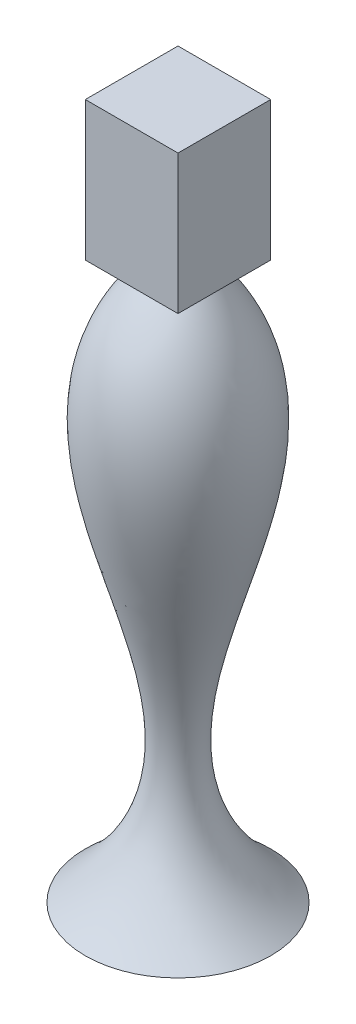
ISO-10303-21;
HEADER;
FILE_DESCRIPTION(('STEP AP214'),'2;1');
FILE_NAME('part.step','',(''),(''),'','','');
FILE_SCHEMA(('AUTOMOTIVE_DESIGN { 1 0 10303 214 1 1 1 1 }'));
ENDSEC;
DATA;
#1=APPLICATION_CONTEXT('core data for automotive mechanical design processes');
#2=APPLICATION_PROTOCOL_DEFINITION('international standard','automotive_design',2000,#1);
#3=PRODUCT_CONTEXT('',#1,'mechanical');
#4=PRODUCT('Part','Part','',(#3));
#5=PRODUCT_RELATED_PRODUCT_CATEGORY('part','',(#4));
#6=PRODUCT_DEFINITION_FORMATION('','',#4);
#7=PRODUCT_DEFINITION_CONTEXT('part definition',#1,'design');
#8=PRODUCT_DEFINITION('design','',#6,#7);
#9=PRODUCT_DEFINITION_SHAPE('','',#8);
#10=(LENGTH_UNIT() NAMED_UNIT(*) SI_UNIT(.MILLI.,.METRE.));
#11=(NAMED_UNIT(*) PLANE_ANGLE_UNIT() SI_UNIT($,.RADIAN.));
#12=(NAMED_UNIT(*) SI_UNIT($,.STERADIAN.) SOLID_ANGLE_UNIT());
#13=UNCERTAINTY_MEASURE_WITH_UNIT(LENGTH_MEASURE(1.E-05),#10,'distance_accuracy_value','');
#14=(GEOMETRIC_REPRESENTATION_CONTEXT(3) GLOBAL_UNCERTAINTY_ASSIGNED_CONTEXT((#13)) GLOBAL_UNIT_ASSIGNED_CONTEXT((#10,
#11,#12)) REPRESENTATION_CONTEXT('',''));
#15=CARTESIAN_POINT('',(0.,0.,0.));
#16=DIRECTION('',(0.,0.,1.));
#17=DIRECTION('',(1.,0.,0.));
#18=AXIS2_PLACEMENT_3D('',#15,#16,#17);
#19=CARTESIAN_POINT('',(0.,-152.4,0.));
#20=DIRECTION('',(0.,1.,0.));
#21=DIRECTION('',(0.,0.,1.));
#22=AXIS2_PLACEMENT_3D('',#19,#20,#21);
#23=PLANE('',#22);
#24=CARTESIAN_POINT('',(0.,-152.4,0.));
#25=DIRECTION('',(0.,-1.,0.));
#26=DIRECTION('',(0.,0.,-1.));
#27=AXIS2_PLACEMENT_3D('',#24,#25,#26);
#28=CIRCLE('',#27,101.6);
#29=CARTESIAN_POINT('',(0.,-152.4,-101.6));
#30=VERTEX_POINT('',#29);
#31=EDGE_CURVE('E11',#30,#30,#28,.T.);
#32=ORIENTED_EDGE('',*,*,#31,.T.);
#33=EDGE_LOOP('',(#32));
#34=FACE_BOUND('',#33,.T.);
#35=ADVANCED_FACE('F32',(#34),#23,.F.);
#36=CARTESIAN_POINT('',(-25.4,457.2,0.));
#37=CARTESIAN_POINT('',(-211.807575975246,256.743639399387,0.));
#38=CARTESIAN_POINT('',(112.233734467282,26.074070803494,0.));
#39=CARTESIAN_POINT('',(-101.6,-152.4,0.));
#40=B_SPLINE_CURVE_WITH_KNOTS('',3,(#36,#37,#38,#39),.UNSPECIFIED.,.F.,.F.,(4,4),(0.,1.),.UNSPECIFIED.);
#41=CARTESIAN_POINT('',(0.,0.,0.));
#42=DIRECTION('',(0.,-1.,0.));
#43=AXIS1_PLACEMENT('',#41,#42);
#44=SURFACE_OF_REVOLUTION('',#40,#43);
#45=ORIENTED_EDGE('',*,*,#31,.F.);
#46=EDGE_LOOP('',(#45));
#47=FACE_BOUND('',#46,.T.);
#48=CARTESIAN_POINT('',(0.,457.2,0.));
#49=DIRECTION('',(0.,-1.,0.));
#50=DIRECTION('',(0.,0.,-1.));
#51=AXIS2_PLACEMENT_3D('',#48,#49,#50);
#52=CIRCLE('',#51,25.4);
#53=CARTESIAN_POINT('',(0.,457.2,-25.4));
#54=VERTEX_POINT('',#53);
#55=EDGE_CURVE('E40',#54,#54,#52,.T.);
#56=ORIENTED_EDGE('',*,*,#55,.T.);
#57=EDGE_LOOP('',(#56));
#58=FACE_BOUND('',#57,.T.);
#59=ADVANCED_FACE('F114',(#47,#58),#44,.T.);
#60=CARTESIAN_POINT('',(-50.8,609.6,-50.8));
#61=DIRECTION('',(1.,0.,0.));
#62=DIRECTION('',(0.,0.,-1.));
#63=AXIS2_PLACEMENT_3D('',#60,#61,#62);
#64=PLANE('',#63);
#65=DIRECTION('',(0.,0.,1.));
#66=VECTOR('',#65,1.);
#67=CARTESIAN_POINT('',(-50.8,457.2,-50.8));
#68=LINE('',#67,#66);
#69=CARTESIAN_POINT('',(-50.8,457.2,-50.8));
#70=VERTEX_POINT('',#69);
#71=CARTESIAN_POINT('',(-50.8,457.2,50.8));
#72=VERTEX_POINT('',#71);
#73=EDGE_CURVE('E99',#70,#72,#68,.T.);
#74=ORIENTED_EDGE('',*,*,#73,.T.);
#75=DIRECTION('',(0.,-1.,0.));
#76=VECTOR('',#75,1.);
#77=CARTESIAN_POINT('',(-50.8,609.6,50.8));
#78=LINE('',#77,#76);
#79=CARTESIAN_POINT('',(-50.8,609.6,50.8));
#80=VERTEX_POINT('',#79);
#81=EDGE_CURVE('E90',#80,#72,#78,.T.);
#82=ORIENTED_EDGE('',*,*,#81,.F.);
#83=DIRECTION('',(0.,0.,1.));
#84=VECTOR('',#83,1.);
#85=CARTESIAN_POINT('',(-50.8,609.6,-50.8));
#86=LINE('',#85,#84);
#87=CARTESIAN_POINT('',(-50.8,609.6,-50.8));
#88=VERTEX_POINT('',#87);
#89=EDGE_CURVE('E84',#88,#80,#86,.T.);
#90=ORIENTED_EDGE('',*,*,#89,.F.);
#91=DIRECTION('',(0.,-1.,0.));
#92=VECTOR('',#91,1.);
#93=CARTESIAN_POINT('',(-50.8,609.6,-50.8));
#94=LINE('',#93,#92);
#95=EDGE_CURVE('E95',#88,#70,#94,.T.);
#96=ORIENTED_EDGE('',*,*,#95,.T.);
#97=EDGE_LOOP('',(#74,#82,#90,#96));
#98=FACE_BOUND('',#97,.T.);
#99=ADVANCED_FACE('F117',(#98),#64,.F.);
#100=CARTESIAN_POINT('',(-50.8,609.6,50.8));
#101=DIRECTION('',(0.,0.,-1.));
#102=DIRECTION('',(-1.,0.,0.));
#103=AXIS2_PLACEMENT_3D('',#100,#101,#102);
#104=PLANE('',#103);
#105=DIRECTION('',(1.,0.,0.));
#106=VECTOR('',#105,1.);
#107=CARTESIAN_POINT('',(-50.8,457.2,50.8));
#108=LINE('',#107,#106);
#109=CARTESIAN_POINT('',(50.8,457.2,50.8));
#110=VERTEX_POINT('',#109);
#111=EDGE_CURVE('E89',#72,#110,#108,.T.);
#112=ORIENTED_EDGE('',*,*,#111,.T.);
#113=DIRECTION('',(0.,-1.,0.));
#114=VECTOR('',#113,1.);
#115=CARTESIAN_POINT('',(50.8,609.6,50.8));
#116=LINE('',#115,#114);
#117=CARTESIAN_POINT('',(50.8,609.6,50.8));
#118=VERTEX_POINT('',#117);
#119=EDGE_CURVE('E87',#118,#110,#116,.T.);
#120=ORIENTED_EDGE('',*,*,#119,.F.);
#121=DIRECTION('',(1.,0.,0.));
#122=VECTOR('',#121,1.);
#123=CARTESIAN_POINT('',(-50.8,609.6,50.8));
#124=LINE('',#123,#122);
#125=EDGE_CURVE('E79',#80,#118,#124,.T.);
#126=ORIENTED_EDGE('',*,*,#125,.F.);
#127=ORIENTED_EDGE('',*,*,#81,.T.);
#128=EDGE_LOOP('',(#112,#120,#126,#127));
#129=FACE_BOUND('',#128,.T.);
#130=ADVANCED_FACE('F88',(#129),#104,.F.);
#131=CARTESIAN_POINT('',(50.8,609.6,-50.8));
#132=DIRECTION('',(-1.,0.,0.));
#133=DIRECTION('',(0.,0.,1.));
#134=AXIS2_PLACEMENT_3D('',#131,#132,#133);
#135=PLANE('',#134);
#136=DIRECTION('',(0.,0.,-1.));
#137=VECTOR('',#136,1.);
#138=CARTESIAN_POINT('',(50.8,457.2,-50.8));
#139=LINE('',#138,#137);
#140=CARTESIAN_POINT('',(50.8,457.2,-50.8));
#141=VERTEX_POINT('',#140);
#142=EDGE_CURVE('E65',#110,#141,#139,.T.);
#143=ORIENTED_EDGE('',*,*,#142,.T.);
#144=DIRECTION('',(0.,-1.,0.));
#145=VECTOR('',#144,1.);
#146=CARTESIAN_POINT('',(50.8,609.6,-50.8));
#147=LINE('',#146,#145);
#148=CARTESIAN_POINT('',(50.8,609.6,-50.8));
#149=VERTEX_POINT('',#148);
#150=EDGE_CURVE('E91',#149,#141,#147,.T.);
#151=ORIENTED_EDGE('',*,*,#150,.F.);
#152=DIRECTION('',(0.,0.,-1.));
#153=VECTOR('',#152,1.);
#154=CARTESIAN_POINT('',(50.8,609.6,-50.8));
#155=LINE('',#154,#153);
#156=EDGE_CURVE('E82',#118,#149,#155,.T.);
#157=ORIENTED_EDGE('',*,*,#156,.F.);
#158=ORIENTED_EDGE('',*,*,#119,.T.);
#159=EDGE_LOOP('',(#143,#151,#157,#158));
#160=FACE_BOUND('',#159,.T.);
#161=ADVANCED_FACE('F93',(#160),#135,.F.);
#162=CARTESIAN_POINT('',(-50.8,609.6,-50.8));
#163=DIRECTION('',(0.,0.,1.));
#164=DIRECTION('',(1.,0.,0.));
#165=AXIS2_PLACEMENT_3D('',#162,#163,#164);
#166=PLANE('',#165);
#167=DIRECTION('',(-1.,0.,0.));
#168=VECTOR('',#167,1.);
#169=CARTESIAN_POINT('',(-50.8,457.2,-50.8));
#170=LINE('',#169,#168);
#171=EDGE_CURVE('E71',#141,#70,#170,.T.);
#172=ORIENTED_EDGE('',*,*,#171,.T.);
#173=ORIENTED_EDGE('',*,*,#95,.F.);
#174=DIRECTION('',(-1.,0.,0.));
#175=VECTOR('',#174,1.);
#176=CARTESIAN_POINT('',(-50.8,609.6,-50.8));
#177=LINE('',#176,#175);
#178=EDGE_CURVE('E48',#149,#88,#177,.T.);
#179=ORIENTED_EDGE('',*,*,#178,.F.);
#180=ORIENTED_EDGE('',*,*,#150,.T.);
#181=EDGE_LOOP('',(#172,#173,#179,#180));
#182=FACE_BOUND('',#181,.T.);
#183=ADVANCED_FACE('F126',(#182),#166,.F.);
#184=CARTESIAN_POINT('',(0.,609.6,0.));
#185=DIRECTION('',(0.,1.,0.));
#186=DIRECTION('',(0.,0.,1.));
#187=AXIS2_PLACEMENT_3D('',#184,#185,#186);
#188=PLANE('',#187);
#189=ORIENTED_EDGE('',*,*,#89,.T.);
#190=ORIENTED_EDGE('',*,*,#125,.T.);
#191=ORIENTED_EDGE('',*,*,#156,.T.);
#192=ORIENTED_EDGE('',*,*,#178,.T.);
#193=EDGE_LOOP('',(#189,#190,#191,#192));
#194=FACE_BOUND('',#193,.T.);
#195=ADVANCED_FACE('F80',(#194),#188,.T.);
#196=CARTESIAN_POINT('',(0.,457.2,0.));
#197=DIRECTION('',(0.,1.,0.));
#198=DIRECTION('',(0.,0.,1.));
#199=AXIS2_PLACEMENT_3D('',#196,#197,#198);
#200=PLANE('',#199);
#201=ORIENTED_EDGE('',*,*,#55,.F.);
#202=EDGE_LOOP('',(#201));
#203=FACE_BOUND('',#202,.T.);
#204=ORIENTED_EDGE('',*,*,#73,.F.);
#205=ORIENTED_EDGE('',*,*,#171,.F.);
#206=ORIENTED_EDGE('',*,*,#142,.F.);
#207=ORIENTED_EDGE('',*,*,#111,.F.);
#208=EDGE_LOOP('',(#204,#205,#206,#207));
#209=FACE_BOUND('',#208,.T.);
#210=ADVANCED_FACE('F129',(#203,#209),#200,.F.);
#211=CLOSED_SHELL('',(#35,#59,#99,#130,#161,#183,#195,#210));
#212=MANIFOLD_SOLID_BREP('B2',#211);
#213=ADVANCED_BREP_SHAPE_REPRESENTATION('',(#18,#212),#14);
#214=SHAPE_DEFINITION_REPRESENTATION(#9,#213);
ENDSEC;
END-ISO-10303-21;
